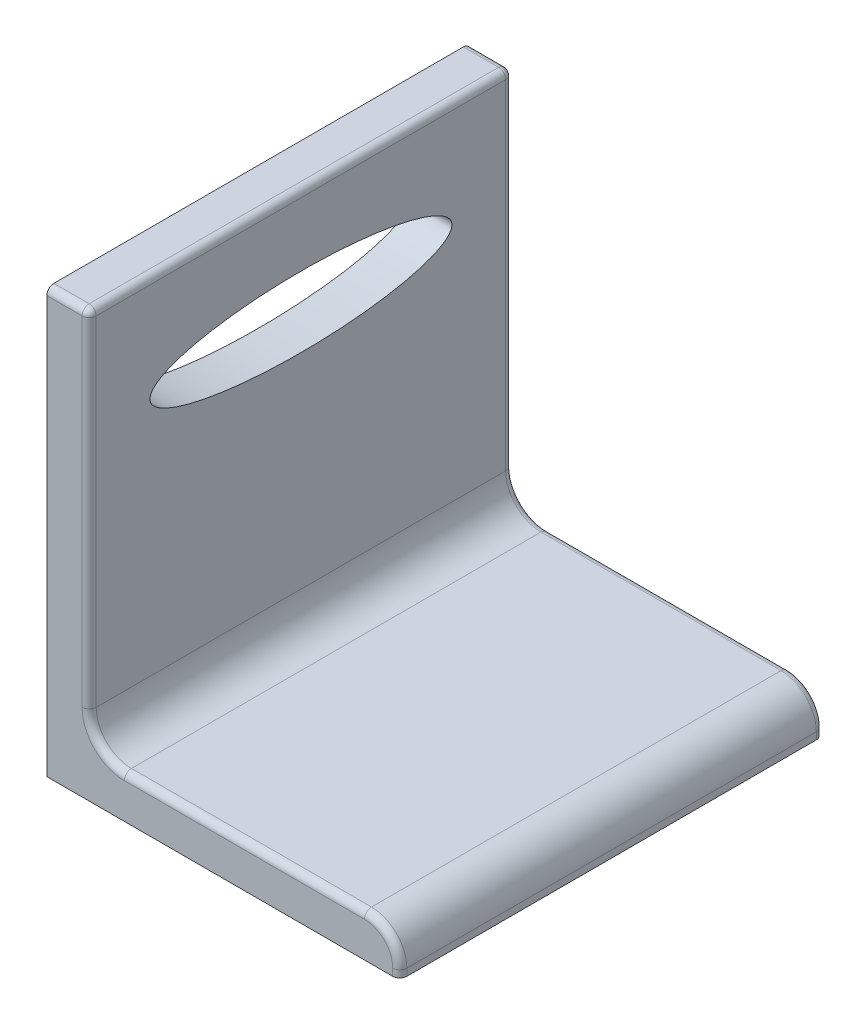
ISO-10303-21;
HEADER;
FILE_DESCRIPTION(('STEP AP214'),'2;1');
FILE_NAME('part.step','',(''),(''),'','','');
FILE_SCHEMA(('AUTOMOTIVE_DESIGN { 1 0 10303 214 1 1 1 1 }'));
ENDSEC;
DATA;
#1=APPLICATION_CONTEXT('core data for automotive mechanical design processes');
#2=APPLICATION_PROTOCOL_DEFINITION('international standard','automotive_design',2000,#1);
#3=PRODUCT_CONTEXT('',#1,'mechanical');
#4=PRODUCT('Part','Part','',(#3));
#5=PRODUCT_RELATED_PRODUCT_CATEGORY('part','',(#4));
#6=PRODUCT_DEFINITION_FORMATION('','',#4);
#7=PRODUCT_DEFINITION_CONTEXT('part definition',#1,'design');
#8=PRODUCT_DEFINITION('design','',#6,#7);
#9=PRODUCT_DEFINITION_SHAPE('','',#8);
#10=(LENGTH_UNIT() NAMED_UNIT(*) SI_UNIT(.MILLI.,.METRE.));
#11=(NAMED_UNIT(*) PLANE_ANGLE_UNIT() SI_UNIT($,.RADIAN.));
#12=(NAMED_UNIT(*) SI_UNIT($,.STERADIAN.) SOLID_ANGLE_UNIT());
#13=UNCERTAINTY_MEASURE_WITH_UNIT(LENGTH_MEASURE(1.E-05),#10,'distance_accuracy_value','');
#14=(GEOMETRIC_REPRESENTATION_CONTEXT(3) GLOBAL_UNCERTAINTY_ASSIGNED_CONTEXT((#13)) GLOBAL_UNIT_ASSIGNED_CONTEXT((#10,
#11,#12)) REPRESENTATION_CONTEXT('',''));
#15=CARTESIAN_POINT('',(0.,0.,0.));
#16=DIRECTION('',(0.,0.,1.));
#17=DIRECTION('',(1.,0.,0.));
#18=AXIS2_PLACEMENT_3D('',#15,#16,#17);
#19=CARTESIAN_POINT('',(0.,0.,-120.));
#20=DIRECTION('',(1.,0.,0.));
#21=DIRECTION('',(0.,0.,-1.));
#22=AXIS2_PLACEMENT_3D('',#19,#20,#21);
#23=PLANE('',#22);
#24=CARTESIAN_POINT('',(0.,90.,-60.));
#25=DIRECTION('',(-1.,0.,0.));
#26=DIRECTION('',(0.,0.,1.));
#27=AXIS2_PLACEMENT_3D('',#24,#25,#26);
#28=ELLIPSE('',#27,42.771597921815,9.99999999999999);
#29=CARTESIAN_POINT('',(0.,90.,-17.228402078185));
#30=VERTEX_POINT('',#29);
#31=EDGE_CURVE('E236',#30,#30,#28,.T.);
#32=ORIENTED_EDGE('',*,*,#31,.F.);
#33=EDGE_LOOP('',(#32));
#34=FACE_BOUND('',#33,.T.);
#35=DIRECTION('',(0.,0.,1.));
#36=VECTOR('',#35,1.);
#37=CARTESIAN_POINT('',(0.,120.,-120.));
#38=LINE('',#37,#36);
#39=CARTESIAN_POINT('',(0.,120.,-118.));
#40=VERTEX_POINT('',#39);
#41=CARTESIAN_POINT('',(0.,120.,-2.));
#42=VERTEX_POINT('',#41);
#43=EDGE_CURVE('E183',#40,#42,#38,.T.);
#44=ORIENTED_EDGE('',*,*,#43,.F.);
#45=CARTESIAN_POINT('',(0.,118.,-118.));
#46=DIRECTION('',(1.,0.,0.));
#47=DIRECTION('',(0.,0.,-1.));
#48=AXIS2_PLACEMENT_3D('',#45,#46,#47);
#49=CIRCLE('',#48,2.);
#50=CARTESIAN_POINT('',(0.,118.,-120.));
#51=VERTEX_POINT('',#50);
#52=EDGE_CURVE('E168',#40,#51,#49,.F.);
#53=ORIENTED_EDGE('',*,*,#52,.T.);
#54=DIRECTION('',(0.,1.,0.));
#55=VECTOR('',#54,1.);
#56=CARTESIAN_POINT('',(0.,0.,-120.));
#57=LINE('',#56,#55);
#58=CARTESIAN_POINT('',(0.,0.,-120.));
#59=VERTEX_POINT('',#58);
#60=EDGE_CURVE('E165',#59,#51,#57,.T.);
#61=ORIENTED_EDGE('',*,*,#60,.F.);
#62=DIRECTION('',(0.,0.,1.));
#63=VECTOR('',#62,1.);
#64=CARTESIAN_POINT('',(0.,0.,-120.));
#65=LINE('',#64,#63);
#66=CARTESIAN_POINT('',(0.,0.,0.));
#67=VERTEX_POINT('',#66);
#68=EDGE_CURVE('E151',#59,#67,#65,.T.);
#69=ORIENTED_EDGE('',*,*,#68,.T.);
#70=DIRECTION('',(0.,1.,0.));
#71=VECTOR('',#70,1.);
#72=CARTESIAN_POINT('',(0.,0.,0.));
#73=LINE('',#72,#71);
#74=CARTESIAN_POINT('',(0.,118.,0.));
#75=VERTEX_POINT('',#74);
#76=EDGE_CURVE('E179',#67,#75,#73,.T.);
#77=ORIENTED_EDGE('',*,*,#76,.T.);
#78=CARTESIAN_POINT('',(0.,118.,-2.));
#79=DIRECTION('',(1.,0.,0.));
#80=DIRECTION('',(0.,0.,-1.));
#81=AXIS2_PLACEMENT_3D('',#78,#79,#80);
#82=CIRCLE('',#81,2.);
#83=EDGE_CURVE('E276',#75,#42,#82,.F.);
#84=ORIENTED_EDGE('',*,*,#83,.T.);
#85=EDGE_LOOP('',(#44,#53,#61,#69,#77,#84));
#86=FACE_BOUND('',#85,.T.);
#87=ADVANCED_FACE('F36',(#34,#86),#23,.F.);
#88=CARTESIAN_POINT('',(0.,120.,-120.));
#89=DIRECTION('',(0.,-1.,0.));
#90=DIRECTION('',(0.,0.,-1.));
#91=AXIS2_PLACEMENT_3D('',#88,#89,#90);
#92=PLANE('',#91);
#93=DIRECTION('',(0.,0.,1.));
#94=VECTOR('',#93,1.);
#95=CARTESIAN_POINT('',(10.,120.,-118.));
#96=LINE('',#95,#94);
#97=CARTESIAN_POINT('',(10.,120.,-2.));
#98=VERTEX_POINT('',#97);
#99=CARTESIAN_POINT('',(10.,120.,-118.));
#100=VERTEX_POINT('',#99);
#101=EDGE_CURVE('E272',#98,#100,#96,.F.);
#102=ORIENTED_EDGE('',*,*,#101,.T.);
#103=DIRECTION('',(1.,0.,0.));
#104=VECTOR('',#103,1.);
#105=CARTESIAN_POINT('',(0.,120.,-118.));
#106=LINE('',#105,#104);
#107=EDGE_CURVE('E274',#100,#40,#106,.F.);
#108=ORIENTED_EDGE('',*,*,#107,.T.);
#109=ORIENTED_EDGE('',*,*,#43,.T.);
#110=DIRECTION('',(1.,0.,0.));
#111=VECTOR('',#110,1.);
#112=CARTESIAN_POINT('',(10.,120.,-2.));
#113=LINE('',#112,#111);
#114=EDGE_CURVE('E270',#42,#98,#113,.T.);
#115=ORIENTED_EDGE('',*,*,#114,.T.);
#116=EDGE_LOOP('',(#102,#108,#109,#115));
#117=FACE_BOUND('',#116,.T.);
#118=ADVANCED_FACE('F303',(#117),#92,.F.);
#119=CARTESIAN_POINT('',(12.,0.,-120.));
#120=DIRECTION('',(1.,0.,0.));
#121=DIRECTION('',(0.,0.,-1.));
#122=AXIS2_PLACEMENT_3D('',#119,#120,#121);
#123=PLANE('',#122);
#124=CARTESIAN_POINT('',(12.,90.,-60.));
#125=DIRECTION('',(-1.,0.,0.));
#126=DIRECTION('',(0.,0.,1.));
#127=AXIS2_PLACEMENT_3D('',#124,#125,#126);
#128=ELLIPSE('',#127,42.771597921815,9.99999999999999);
#129=CARTESIAN_POINT('',(12.,90.,-17.228402078185));
#130=VERTEX_POINT('',#129);
#131=EDGE_CURVE('E181',#130,#130,#128,.T.);
#132=ORIENTED_EDGE('',*,*,#131,.T.);
#133=EDGE_LOOP('',(#132));
#134=FACE_BOUND('',#133,.T.);
#135=DIRECTION('',(0.,1.,0.));
#136=VECTOR('',#135,1.);
#137=CARTESIAN_POINT('',(12.,120.,-118.));
#138=LINE('',#137,#136);
#139=CARTESIAN_POINT('',(12.,22.,-118.));
#140=VERTEX_POINT('',#139);
#141=CARTESIAN_POINT('',(12.,118.,-118.));
#142=VERTEX_POINT('',#141);
#143=EDGE_CURVE('E223',#140,#142,#138,.T.);
#144=ORIENTED_EDGE('',*,*,#143,.T.);
#145=DIRECTION('',(0.,0.,1.));
#146=VECTOR('',#145,1.);
#147=CARTESIAN_POINT('',(12.,118.,-2.));
#148=LINE('',#147,#146);
#149=CARTESIAN_POINT('',(12.,118.,-2.));
#150=VERTEX_POINT('',#149);
#151=EDGE_CURVE('E60',#142,#150,#148,.T.);
#152=ORIENTED_EDGE('',*,*,#151,.T.);
#153=DIRECTION('',(0.,1.,0.));
#154=VECTOR('',#153,1.);
#155=CARTESIAN_POINT('',(12.,0.,-2.));
#156=LINE('',#155,#154);
#157=CARTESIAN_POINT('',(12.,22.,-2.));
#158=VERTEX_POINT('',#157);
#159=EDGE_CURVE('E213',#150,#158,#156,.F.);
#160=ORIENTED_EDGE('',*,*,#159,.T.);
#161=DIRECTION('',(0.,0.,1.));
#162=VECTOR('',#161,1.);
#163=CARTESIAN_POINT('',(12.,22.,-120.));
#164=LINE('',#163,#162);
#165=EDGE_CURVE('E194',#158,#140,#164,.F.);
#166=ORIENTED_EDGE('',*,*,#165,.T.);
#167=EDGE_LOOP('',(#144,#152,#160,#166));
#168=FACE_BOUND('',#167,.T.);
#169=ADVANCED_FACE('F370',(#134,#168),#123,.T.);
#170=CARTESIAN_POINT('',(0.,12.,-120.));
#171=DIRECTION('',(0.,-1.,0.));
#172=DIRECTION('',(0.,0.,-1.));
#173=AXIS2_PLACEMENT_3D('',#170,#171,#172);
#174=PLANE('',#173);
#175=DIRECTION('',(0.,0.,1.));
#176=VECTOR('',#175,1.);
#177=CARTESIAN_POINT('',(90.,12.,-120.));
#178=LINE('',#177,#176);
#179=CARTESIAN_POINT('',(90.,12.,-2.));
#180=VERTEX_POINT('',#179);
#181=CARTESIAN_POINT('',(90.,12.,-118.));
#182=VERTEX_POINT('',#181);
#183=EDGE_CURVE('E189',#180,#182,#178,.F.);
#184=ORIENTED_EDGE('',*,*,#183,.T.);
#185=DIRECTION('',(1.,0.,0.));
#186=VECTOR('',#185,1.);
#187=CARTESIAN_POINT('',(0.,12.,-118.));
#188=LINE('',#187,#186);
#189=CARTESIAN_POINT('',(22.,12.,-118.));
#190=VERTEX_POINT('',#189);
#191=EDGE_CURVE('E249',#182,#190,#188,.F.);
#192=ORIENTED_EDGE('',*,*,#191,.T.);
#193=DIRECTION('',(0.,0.,1.));
#194=VECTOR('',#193,1.);
#195=CARTESIAN_POINT('',(22.,12.,-120.));
#196=LINE('',#195,#194);
#197=CARTESIAN_POINT('',(22.,12.,-2.));
#198=VERTEX_POINT('',#197);
#199=EDGE_CURVE('E192',#190,#198,#196,.T.);
#200=ORIENTED_EDGE('',*,*,#199,.T.);
#201=DIRECTION('',(1.,0.,0.));
#202=VECTOR('',#201,1.);
#203=CARTESIAN_POINT('',(90.,12.,-2.));
#204=LINE('',#203,#202);
#205=EDGE_CURVE('E218',#198,#180,#204,.T.);
#206=ORIENTED_EDGE('',*,*,#205,.T.);
#207=EDGE_LOOP('',(#184,#192,#200,#206));
#208=FACE_BOUND('',#207,.T.);
#209=ADVANCED_FACE('F360',(#208),#174,.F.);
#210=CARTESIAN_POINT('',(100.,0.,-120.));
#211=DIRECTION('',(1.,0.,0.));
#212=DIRECTION('',(0.,0.,-1.));
#213=AXIS2_PLACEMENT_3D('',#210,#211,#212);
#214=PLANE('',#213);
#215=DIRECTION('',(0.,0.,1.));
#216=VECTOR('',#215,1.);
#217=CARTESIAN_POINT('',(100.,0.,-120.));
#218=LINE('',#217,#216);
#219=CARTESIAN_POINT('',(100.,0.,-118.));
#220=VERTEX_POINT('',#219);
#221=CARTESIAN_POINT('',(100.,0.,-2.));
#222=VERTEX_POINT('',#221);
#223=EDGE_CURVE('E162',#220,#222,#218,.T.);
#224=ORIENTED_EDGE('',*,*,#223,.F.);
#225=DIRECTION('',(0.,1.,0.));
#226=VECTOR('',#225,1.);
#227=CARTESIAN_POINT('',(100.,2.,-118.));
#228=LINE('',#227,#226);
#229=CARTESIAN_POINT('',(100.,2.,-118.));
#230=VERTEX_POINT('',#229);
#231=EDGE_CURVE('E251',#220,#230,#228,.T.);
#232=ORIENTED_EDGE('',*,*,#231,.T.);
#233=DIRECTION('',(0.,0.,1.));
#234=VECTOR('',#233,1.);
#235=CARTESIAN_POINT('',(100.,2.,0.));
#236=LINE('',#235,#234);
#237=CARTESIAN_POINT('',(100.,2.,-2.));
#238=VERTEX_POINT('',#237);
#239=EDGE_CURVE('E186',#230,#238,#236,.T.);
#240=ORIENTED_EDGE('',*,*,#239,.T.);
#241=DIRECTION('',(0.,1.,0.));
#242=VECTOR('',#241,1.);
#243=CARTESIAN_POINT('',(100.,0.,-2.));
#244=LINE('',#243,#242);
#245=EDGE_CURVE('E208',#238,#222,#244,.F.);
#246=ORIENTED_EDGE('',*,*,#245,.T.);
#247=EDGE_LOOP('',(#224,#232,#240,#246));
#248=FACE_BOUND('',#247,.T.);
#249=ADVANCED_FACE('F337',(#248),#214,.T.);
#250=CARTESIAN_POINT('',(0.,0.,-120.));
#251=DIRECTION('',(0.,-1.,0.));
#252=DIRECTION('',(0.,0.,-1.));
#253=AXIS2_PLACEMENT_3D('',#250,#251,#252);
#254=PLANE('',#253);
#255=DIRECTION('',(1.,0.,0.));
#256=VECTOR('',#255,1.);
#257=CARTESIAN_POINT('',(0.,0.,-120.));
#258=LINE('',#257,#256);
#259=CARTESIAN_POINT('',(98.,0.,-120.));
#260=VERTEX_POINT('',#259);
#261=EDGE_CURVE('E155',#59,#260,#258,.T.);
#262=ORIENTED_EDGE('',*,*,#261,.T.);
#263=CARTESIAN_POINT('',(98.,0.,-118.));
#264=DIRECTION('',(0.,-1.,0.));
#265=DIRECTION('',(0.,0.,-1.));
#266=AXIS2_PLACEMENT_3D('',#263,#264,#265);
#267=CIRCLE('',#266,2.);
#268=EDGE_CURVE('E253',#260,#220,#267,.T.);
#269=ORIENTED_EDGE('',*,*,#268,.T.);
#270=ORIENTED_EDGE('',*,*,#223,.T.);
#271=CARTESIAN_POINT('',(98.,0.,-2.));
#272=DIRECTION('',(0.,-1.,0.));
#273=DIRECTION('',(0.,0.,-1.));
#274=AXIS2_PLACEMENT_3D('',#271,#272,#273);
#275=CIRCLE('',#274,2.);
#276=CARTESIAN_POINT('',(98.,0.,0.));
#277=VERTEX_POINT('',#276);
#278=EDGE_CURVE('E211',#222,#277,#275,.T.);
#279=ORIENTED_EDGE('',*,*,#278,.T.);
#280=DIRECTION('',(1.,0.,0.));
#281=VECTOR('',#280,1.);
#282=CARTESIAN_POINT('',(0.,0.,0.));
#283=LINE('',#282,#281);
#284=EDGE_CURVE('E158',#67,#277,#283,.T.);
#285=ORIENTED_EDGE('',*,*,#284,.F.);
#286=ORIENTED_EDGE('',*,*,#68,.F.);
#287=EDGE_LOOP('',(#262,#269,#270,#279,#285,#286));
#288=FACE_BOUND('',#287,.T.);
#289=ADVANCED_FACE('F153',(#288),#254,.T.);
#290=CARTESIAN_POINT('',(0.,0.,-120.));
#291=DIRECTION('',(0.,0.,1.));
#292=DIRECTION('',(1.,0.,0.));
#293=AXIS2_PLACEMENT_3D('',#290,#291,#292);
#294=PLANE('',#293);
#295=ORIENTED_EDGE('',*,*,#60,.T.);
#296=DIRECTION('',(1.,0.,0.));
#297=VECTOR('',#296,1.);
#298=CARTESIAN_POINT('',(0.,118.,-120.));
#299=LINE('',#298,#297);
#300=CARTESIAN_POINT('',(10.,118.,-120.));
#301=VERTEX_POINT('',#300);
#302=EDGE_CURVE('E257',#51,#301,#299,.T.);
#303=ORIENTED_EDGE('',*,*,#302,.T.);
#304=DIRECTION('',(0.,1.,0.));
#305=VECTOR('',#304,1.);
#306=CARTESIAN_POINT('',(10.,22.,-120.));
#307=LINE('',#306,#305);
#308=CARTESIAN_POINT('',(10.,22.,-120.));
#309=VERTEX_POINT('',#308);
#310=EDGE_CURVE('E245',#301,#309,#307,.F.);
#311=ORIENTED_EDGE('',*,*,#310,.T.);
#312=CARTESIAN_POINT('',(22.,22.,-120.));
#313=DIRECTION('',(0.,0.,1.));
#314=DIRECTION('',(1.,0.,0.));
#315=AXIS2_PLACEMENT_3D('',#312,#313,#314);
#316=CIRCLE('',#315,12.);
#317=CARTESIAN_POINT('',(22.,10.,-120.));
#318=VERTEX_POINT('',#317);
#319=EDGE_CURVE('E243',#309,#318,#316,.T.);
#320=ORIENTED_EDGE('',*,*,#319,.T.);
#321=DIRECTION('',(1.,0.,0.));
#322=VECTOR('',#321,1.);
#323=CARTESIAN_POINT('',(0.,10.,-120.));
#324=LINE('',#323,#322);
#325=CARTESIAN_POINT('',(90.,10.,-120.));
#326=VERTEX_POINT('',#325);
#327=EDGE_CURVE('E241',#318,#326,#324,.T.);
#328=ORIENTED_EDGE('',*,*,#327,.T.);
#329=CARTESIAN_POINT('',(90.,2.,-120.));
#330=DIRECTION('',(0.,0.,1.));
#331=DIRECTION('',(1.,0.,0.));
#332=AXIS2_PLACEMENT_3D('',#329,#330,#331);
#333=CIRCLE('',#332,8.);
#334=CARTESIAN_POINT('',(98.,2.,-120.));
#335=VERTEX_POINT('',#334);
#336=EDGE_CURVE('E238',#326,#335,#333,.F.);
#337=ORIENTED_EDGE('',*,*,#336,.T.);
#338=DIRECTION('',(0.,1.,0.));
#339=VECTOR('',#338,1.);
#340=CARTESIAN_POINT('',(98.,0.,-120.));
#341=LINE('',#340,#339);
#342=EDGE_CURVE('E175',#335,#260,#341,.F.);
#343=ORIENTED_EDGE('',*,*,#342,.T.);
#344=ORIENTED_EDGE('',*,*,#261,.F.);
#345=EDGE_LOOP('',(#295,#303,#311,#320,#328,#337,#343,#344));
#346=FACE_BOUND('',#345,.T.);
#347=ADVANCED_FACE('F173',(#346),#294,.F.);
#348=CARTESIAN_POINT('',(0.,0.,0.));
#349=DIRECTION('',(0.,0.,1.));
#350=DIRECTION('',(1.,0.,0.));
#351=AXIS2_PLACEMENT_3D('',#348,#349,#350);
#352=PLANE('',#351);
#353=DIRECTION('',(0.,1.,0.));
#354=VECTOR('',#353,1.);
#355=CARTESIAN_POINT('',(10.,0.,0.));
#356=LINE('',#355,#354);
#357=CARTESIAN_POINT('',(10.,22.,0.));
#358=VERTEX_POINT('',#357);
#359=CARTESIAN_POINT('',(10.,118.,0.));
#360=VERTEX_POINT('',#359);
#361=EDGE_CURVE('E203',#358,#360,#356,.T.);
#362=ORIENTED_EDGE('',*,*,#361,.T.);
#363=DIRECTION('',(1.,0.,0.));
#364=VECTOR('',#363,1.);
#365=CARTESIAN_POINT('',(0.,118.,0.));
#366=LINE('',#365,#364);
#367=EDGE_CURVE('E11',#360,#75,#366,.F.);
#368=ORIENTED_EDGE('',*,*,#367,.T.);
#369=ORIENTED_EDGE('',*,*,#76,.F.);
#370=ORIENTED_EDGE('',*,*,#284,.T.);
#371=DIRECTION('',(0.,1.,0.));
#372=VECTOR('',#371,1.);
#373=CARTESIAN_POINT('',(98.,0.,0.));
#374=LINE('',#373,#372);
#375=CARTESIAN_POINT('',(98.,2.,0.));
#376=VERTEX_POINT('',#375);
#377=EDGE_CURVE('E205',#277,#376,#374,.T.);
#378=ORIENTED_EDGE('',*,*,#377,.T.);
#379=CARTESIAN_POINT('',(90.,2.,0.));
#380=DIRECTION('',(0.,0.,1.));
#381=DIRECTION('',(1.,0.,0.));
#382=AXIS2_PLACEMENT_3D('',#379,#380,#381);
#383=CIRCLE('',#382,8.);
#384=CARTESIAN_POINT('',(90.,10.,0.));
#385=VERTEX_POINT('',#384);
#386=EDGE_CURVE('E197',#376,#385,#383,.T.);
#387=ORIENTED_EDGE('',*,*,#386,.T.);
#388=DIRECTION('',(1.,0.,0.));
#389=VECTOR('',#388,1.);
#390=CARTESIAN_POINT('',(22.,10.,0.));
#391=LINE('',#390,#389);
#392=CARTESIAN_POINT('',(22.,10.,0.));
#393=VERTEX_POINT('',#392);
#394=EDGE_CURVE('E199',#385,#393,#391,.F.);
#395=ORIENTED_EDGE('',*,*,#394,.T.);
#396=CARTESIAN_POINT('',(22.,22.,0.));
#397=DIRECTION('',(0.,0.,1.));
#398=DIRECTION('',(1.,0.,0.));
#399=AXIS2_PLACEMENT_3D('',#396,#397,#398);
#400=CIRCLE('',#399,12.);
#401=EDGE_CURVE('E201',#393,#358,#400,.F.);
#402=ORIENTED_EDGE('',*,*,#401,.T.);
#403=EDGE_LOOP('',(#362,#368,#369,#370,#378,#387,#395,#402));
#404=FACE_BOUND('',#403,.T.);
#405=ADVANCED_FACE('F301',(#404),#352,.T.);
#406=DIRECTION('',(-1.,0.,0.));
#407=VECTOR('',#406,1.);
#408=SURFACE_OF_LINEAR_EXTRUSION('',#128,#407);
#409=ORIENTED_EDGE('',*,*,#131,.F.);
#410=EDGE_LOOP('',(#409));
#411=FACE_BOUND('',#410,.T.);
#412=ORIENTED_EDGE('',*,*,#31,.T.);
#413=EDGE_LOOP('',(#412));
#414=FACE_BOUND('',#413,.T.);
#415=ADVANCED_FACE('F392',(#411,#414),#408,.F.);
#416=CARTESIAN_POINT('',(90.,2.,-120.));
#417=DIRECTION('',(0.,0.,-1.));
#418=DIRECTION('',(-1.,0.,0.));
#419=AXIS2_PLACEMENT_3D('',#416,#417,#418);
#420=CYLINDRICAL_SURFACE('',#419,10.);
#421=ORIENTED_EDGE('',*,*,#239,.F.);
#422=CARTESIAN_POINT('',(90.,2.,-118.));
#423=DIRECTION('',(0.,0.,1.));
#424=DIRECTION('',(1.,0.,0.));
#425=AXIS2_PLACEMENT_3D('',#422,#423,#424);
#426=CIRCLE('',#425,10.);
#427=EDGE_CURVE('E255',#230,#182,#426,.T.);
#428=ORIENTED_EDGE('',*,*,#427,.T.);
#429=ORIENTED_EDGE('',*,*,#183,.F.);
#430=CARTESIAN_POINT('',(90.,2.,-2.));
#431=DIRECTION('',(0.,0.,1.));
#432=DIRECTION('',(1.,0.,0.));
#433=AXIS2_PLACEMENT_3D('',#430,#431,#432);
#434=CIRCLE('',#433,10.);
#435=EDGE_CURVE('E220',#180,#238,#434,.F.);
#436=ORIENTED_EDGE('',*,*,#435,.T.);
#437=EDGE_LOOP('',(#421,#428,#429,#436));
#438=FACE_BOUND('',#437,.T.);
#439=ADVANCED_FACE('F358',(#438),#420,.T.);
#440=CARTESIAN_POINT('',(22.,22.,-120.));
#441=DIRECTION('',(0.,0.,1.));
#442=DIRECTION('',(1.,0.,0.));
#443=AXIS2_PLACEMENT_3D('',#440,#441,#442);
#444=CYLINDRICAL_SURFACE('',#443,10.);
#445=ORIENTED_EDGE('',*,*,#199,.F.);
#446=CARTESIAN_POINT('',(22.,22.,-118.));
#447=DIRECTION('',(0.,0.,1.));
#448=DIRECTION('',(1.,0.,0.));
#449=AXIS2_PLACEMENT_3D('',#446,#447,#448);
#450=CIRCLE('',#449,10.);
#451=EDGE_CURVE('E247',#190,#140,#450,.F.);
#452=ORIENTED_EDGE('',*,*,#451,.T.);
#453=ORIENTED_EDGE('',*,*,#165,.F.);
#454=CARTESIAN_POINT('',(22.,22.,-2.));
#455=DIRECTION('',(0.,0.,1.));
#456=DIRECTION('',(1.,0.,0.));
#457=AXIS2_PLACEMENT_3D('',#454,#455,#456);
#458=CIRCLE('',#457,10.);
#459=EDGE_CURVE('E215',#158,#198,#458,.T.);
#460=ORIENTED_EDGE('',*,*,#459,.T.);
#461=EDGE_LOOP('',(#445,#452,#453,#460));
#462=FACE_BOUND('',#461,.T.);
#463=ADVANCED_FACE('F365',(#462),#444,.F.);
#464=CARTESIAN_POINT('',(10.,0.,-2.));
#465=DIRECTION('',(0.,1.,0.));
#466=DIRECTION('',(0.,0.,1.));
#467=AXIS2_PLACEMENT_3D('',#464,#465,#466);
#468=CYLINDRICAL_SURFACE('',#467,2.);
#469=ORIENTED_EDGE('',*,*,#159,.F.);
#470=CARTESIAN_POINT('',(10.,118.,-2.));
#471=DIRECTION('',(0.,1.,0.));
#472=DIRECTION('',(0.,0.,1.));
#473=AXIS2_PLACEMENT_3D('',#470,#471,#472);
#474=CIRCLE('',#473,2.);
#475=EDGE_CURVE('E45',#150,#360,#474,.F.);
#476=ORIENTED_EDGE('',*,*,#475,.T.);
#477=ORIENTED_EDGE('',*,*,#361,.F.);
#478=CARTESIAN_POINT('',(10.,22.,-2.));
#479=DIRECTION('',(0.,-1.,0.));
#480=DIRECTION('',(0.,0.,-1.));
#481=AXIS2_PLACEMENT_3D('',#478,#479,#480);
#482=CIRCLE('',#481,2.);
#483=EDGE_CURVE('E233',#158,#358,#482,.T.);
#484=ORIENTED_EDGE('',*,*,#483,.F.);
#485=EDGE_LOOP('',(#469,#476,#477,#484));
#486=FACE_BOUND('',#485,.T.);
#487=ADVANCED_FACE('F369',(#486),#468,.T.);
#488=CARTESIAN_POINT('',(22.,22.,-2.));
#489=DIRECTION('',(0.,0.,1.));
#490=DIRECTION('',(1.,0.,0.));
#491=AXIS2_PLACEMENT_3D('',#488,#489,#490);
#492=TOROIDAL_SURFACE('',#491,12.,2.);
#493=ORIENTED_EDGE('',*,*,#483,.T.);
#494=ORIENTED_EDGE('',*,*,#401,.F.);
#495=CARTESIAN_POINT('',(22.,10.,-2.));
#496=DIRECTION('',(1.,0.,0.));
#497=DIRECTION('',(0.,0.,-1.));
#498=AXIS2_PLACEMENT_3D('',#495,#496,#497);
#499=CIRCLE('',#498,2.);
#500=EDGE_CURVE('E230',#198,#393,#499,.T.);
#501=ORIENTED_EDGE('',*,*,#500,.F.);
#502=ORIENTED_EDGE('',*,*,#459,.F.);
#503=EDGE_LOOP('',(#493,#494,#501,#502));
#504=FACE_BOUND('',#503,.T.);
#505=ADVANCED_FACE('F368',(#504),#492,.T.);
#506=CARTESIAN_POINT('',(0.,10.,-2.));
#507=DIRECTION('',(-1.,0.,0.));
#508=DIRECTION('',(0.,0.,1.));
#509=AXIS2_PLACEMENT_3D('',#506,#507,#508);
#510=CYLINDRICAL_SURFACE('',#509,2.);
#511=ORIENTED_EDGE('',*,*,#500,.T.);
#512=ORIENTED_EDGE('',*,*,#394,.F.);
#513=CARTESIAN_POINT('',(90.,10.,-2.));
#514=DIRECTION('',(1.,0.,0.));
#515=DIRECTION('',(0.,0.,-1.));
#516=AXIS2_PLACEMENT_3D('',#513,#514,#515);
#517=CIRCLE('',#516,2.);
#518=EDGE_CURVE('E226',#180,#385,#517,.T.);
#519=ORIENTED_EDGE('',*,*,#518,.F.);
#520=ORIENTED_EDGE('',*,*,#205,.F.);
#521=EDGE_LOOP('',(#511,#512,#519,#520));
#522=FACE_BOUND('',#521,.T.);
#523=ADVANCED_FACE('F351',(#522),#510,.T.);
#524=CARTESIAN_POINT('',(90.,2.,-2.));
#525=DIRECTION('',(0.,0.,1.));
#526=DIRECTION('',(1.,0.,0.));
#527=AXIS2_PLACEMENT_3D('',#524,#525,#526);
#528=TOROIDAL_SURFACE('',#527,8.,2.);
#529=ORIENTED_EDGE('',*,*,#518,.T.);
#530=ORIENTED_EDGE('',*,*,#386,.F.);
#531=CARTESIAN_POINT('',(98.,2.,-2.));
#532=DIRECTION('',(0.,-1.,0.));
#533=DIRECTION('',(0.,0.,-1.));
#534=AXIS2_PLACEMENT_3D('',#531,#532,#533);
#535=CIRCLE('',#534,2.);
#536=EDGE_CURVE('E224',#238,#376,#535,.T.);
#537=ORIENTED_EDGE('',*,*,#536,.F.);
#538=ORIENTED_EDGE('',*,*,#435,.F.);
#539=EDGE_LOOP('',(#529,#530,#537,#538));
#540=FACE_BOUND('',#539,.T.);
#541=ADVANCED_FACE('F355',(#540),#528,.T.);
#542=CARTESIAN_POINT('',(98.,0.,-2.));
#543=DIRECTION('',(0.,1.,0.));
#544=DIRECTION('',(0.,0.,1.));
#545=AXIS2_PLACEMENT_3D('',#542,#543,#544);
#546=CYLINDRICAL_SURFACE('',#545,2.);
#547=ORIENTED_EDGE('',*,*,#278,.F.);
#548=ORIENTED_EDGE('',*,*,#245,.F.);
#549=ORIENTED_EDGE('',*,*,#536,.T.);
#550=ORIENTED_EDGE('',*,*,#377,.F.);
#551=EDGE_LOOP('',(#547,#548,#549,#550));
#552=FACE_BOUND('',#551,.T.);
#553=ADVANCED_FACE('F344',(#552),#546,.T.);
#554=CARTESIAN_POINT('',(98.,0.,-118.));
#555=DIRECTION('',(0.,-1.,0.));
#556=DIRECTION('',(0.,0.,-1.));
#557=AXIS2_PLACEMENT_3D('',#554,#555,#556);
#558=CYLINDRICAL_SURFACE('',#557,2.);
#559=ORIENTED_EDGE('',*,*,#268,.F.);
#560=ORIENTED_EDGE('',*,*,#342,.F.);
#561=CARTESIAN_POINT('',(98.,2.,-118.));
#562=DIRECTION('',(0.,1.,0.));
#563=DIRECTION('',(0.,0.,1.));
#564=AXIS2_PLACEMENT_3D('',#561,#562,#563);
#565=CIRCLE('',#564,2.);
#566=EDGE_CURVE('E227',#230,#335,#565,.T.);
#567=ORIENTED_EDGE('',*,*,#566,.F.);
#568=ORIENTED_EDGE('',*,*,#231,.F.);
#569=EDGE_LOOP('',(#559,#560,#567,#568));
#570=FACE_BOUND('',#569,.T.);
#571=ADVANCED_FACE('F333',(#570),#558,.T.);
#572=CARTESIAN_POINT('',(90.,2.,-118.));
#573=DIRECTION('',(0.,0.,1.));
#574=DIRECTION('',(1.,0.,0.));
#575=AXIS2_PLACEMENT_3D('',#572,#573,#574);
#576=TOROIDAL_SURFACE('',#575,8.,2.);
#577=ORIENTED_EDGE('',*,*,#566,.T.);
#578=ORIENTED_EDGE('',*,*,#336,.F.);
#579=CARTESIAN_POINT('',(90.,10.,-118.));
#580=DIRECTION('',(-1.,0.,0.));
#581=DIRECTION('',(0.,0.,1.));
#582=AXIS2_PLACEMENT_3D('',#579,#580,#581);
#583=CIRCLE('',#582,2.);
#584=EDGE_CURVE('E264',#182,#326,#583,.T.);
#585=ORIENTED_EDGE('',*,*,#584,.F.);
#586=ORIENTED_EDGE('',*,*,#427,.F.);
#587=EDGE_LOOP('',(#577,#578,#585,#586));
#588=FACE_BOUND('',#587,.T.);
#589=ADVANCED_FACE('F330',(#588),#576,.T.);
#590=CARTESIAN_POINT('',(0.,10.,-118.));
#591=DIRECTION('',(1.,0.,0.));
#592=DIRECTION('',(0.,0.,-1.));
#593=AXIS2_PLACEMENT_3D('',#590,#591,#592);
#594=CYLINDRICAL_SURFACE('',#593,2.);
#595=ORIENTED_EDGE('',*,*,#584,.T.);
#596=ORIENTED_EDGE('',*,*,#327,.F.);
#597=CARTESIAN_POINT('',(22.,10.,-118.));
#598=DIRECTION('',(-1.,0.,0.));
#599=DIRECTION('',(0.,0.,1.));
#600=AXIS2_PLACEMENT_3D('',#597,#598,#599);
#601=CIRCLE('',#600,2.);
#602=EDGE_CURVE('E261',#190,#318,#601,.T.);
#603=ORIENTED_EDGE('',*,*,#602,.F.);
#604=ORIENTED_EDGE('',*,*,#191,.F.);
#605=EDGE_LOOP('',(#595,#596,#603,#604));
#606=FACE_BOUND('',#605,.T.);
#607=ADVANCED_FACE('F325',(#606),#594,.T.);
#608=CARTESIAN_POINT('',(22.,22.,-118.));
#609=DIRECTION('',(0.,0.,1.));
#610=DIRECTION('',(1.,0.,0.));
#611=AXIS2_PLACEMENT_3D('',#608,#609,#610);
#612=TOROIDAL_SURFACE('',#611,12.,2.);
#613=ORIENTED_EDGE('',*,*,#602,.T.);
#614=ORIENTED_EDGE('',*,*,#319,.F.);
#615=CARTESIAN_POINT('',(10.,22.,-118.));
#616=DIRECTION('',(0.,1.,0.));
#617=DIRECTION('',(0.,0.,1.));
#618=AXIS2_PLACEMENT_3D('',#615,#616,#617);
#619=CIRCLE('',#618,2.);
#620=EDGE_CURVE('E258',#140,#309,#619,.T.);
#621=ORIENTED_EDGE('',*,*,#620,.F.);
#622=ORIENTED_EDGE('',*,*,#451,.F.);
#623=EDGE_LOOP('',(#613,#614,#621,#622));
#624=FACE_BOUND('',#623,.T.);
#625=ADVANCED_FACE('F320',(#624),#612,.T.);
#626=CARTESIAN_POINT('',(10.,0.,-118.));
#627=DIRECTION('',(0.,-1.,0.));
#628=DIRECTION('',(0.,0.,-1.));
#629=AXIS2_PLACEMENT_3D('',#626,#627,#628);
#630=CYLINDRICAL_SURFACE('',#629,2.);
#631=ORIENTED_EDGE('',*,*,#310,.F.);
#632=CARTESIAN_POINT('',(10.,118.,-118.));
#633=DIRECTION('',(0.,-1.,0.));
#634=DIRECTION('',(0.,0.,-1.));
#635=AXIS2_PLACEMENT_3D('',#632,#633,#634);
#636=CIRCLE('',#635,2.);
#637=EDGE_CURVE('E279',#301,#142,#636,.T.);
#638=ORIENTED_EDGE('',*,*,#637,.T.);
#639=ORIENTED_EDGE('',*,*,#143,.F.);
#640=ORIENTED_EDGE('',*,*,#620,.T.);
#641=EDGE_LOOP('',(#631,#638,#639,#640));
#642=FACE_BOUND('',#641,.T.);
#643=ADVANCED_FACE('F316',(#642),#630,.T.);
#644=CARTESIAN_POINT('',(0.,118.,-2.));
#645=DIRECTION('',(-1.,0.,0.));
#646=DIRECTION('',(0.,0.,1.));
#647=AXIS2_PLACEMENT_3D('',#644,#645,#646);
#648=CYLINDRICAL_SURFACE('',#647,2.);
#649=ORIENTED_EDGE('',*,*,#83,.F.);
#650=ORIENTED_EDGE('',*,*,#367,.F.);
#651=CARTESIAN_POINT('',(10.,118.,-2.));
#652=DIRECTION('',(1.,0.,0.));
#653=DIRECTION('',(0.,0.,-1.));
#654=AXIS2_PLACEMENT_3D('',#651,#652,#653);
#655=CIRCLE('',#654,2.);
#656=EDGE_CURVE('E40',#98,#360,#655,.T.);
#657=ORIENTED_EDGE('',*,*,#656,.F.);
#658=ORIENTED_EDGE('',*,*,#114,.F.);
#659=EDGE_LOOP('',(#649,#650,#657,#658));
#660=FACE_BOUND('',#659,.T.);
#661=ADVANCED_FACE('F38',(#660),#648,.T.);
#662=CARTESIAN_POINT('',(10.,118.,-2.));
#663=DIRECTION('',(0.,0.,1.));
#664=DIRECTION('',(1.,0.,0.));
#665=AXIS2_PLACEMENT_3D('',#662,#663,#664);
#666=SPHERICAL_SURFACE('',#665,2.);
#667=ORIENTED_EDGE('',*,*,#656,.T.);
#668=ORIENTED_EDGE('',*,*,#475,.F.);
#669=CARTESIAN_POINT('',(10.,118.,-2.));
#670=DIRECTION('',(0.,0.,-1.));
#671=DIRECTION('',(-1.,0.,0.));
#672=AXIS2_PLACEMENT_3D('',#669,#670,#671);
#673=CIRCLE('',#672,2.);
#674=EDGE_CURVE('E287',#98,#150,#673,.T.);
#675=ORIENTED_EDGE('',*,*,#674,.F.);
#676=EDGE_LOOP('',(#667,#668,#675));
#677=FACE_BOUND('',#676,.T.);
#678=ADVANCED_FACE('F295',(#677),#666,.T.);
#679=CARTESIAN_POINT('',(10.,118.,-120.));
#680=DIRECTION('',(0.,0.,-1.));
#681=DIRECTION('',(-1.,0.,0.));
#682=AXIS2_PLACEMENT_3D('',#679,#680,#681);
#683=CYLINDRICAL_SURFACE('',#682,2.);
#684=ORIENTED_EDGE('',*,*,#674,.T.);
#685=ORIENTED_EDGE('',*,*,#151,.F.);
#686=CARTESIAN_POINT('',(10.,118.,-118.));
#687=DIRECTION('',(0.,0.,-1.));
#688=DIRECTION('',(-1.,0.,0.));
#689=AXIS2_PLACEMENT_3D('',#686,#687,#688);
#690=CIRCLE('',#689,2.);
#691=EDGE_CURVE('E285',#100,#142,#690,.T.);
#692=ORIENTED_EDGE('',*,*,#691,.F.);
#693=ORIENTED_EDGE('',*,*,#101,.F.);
#694=EDGE_LOOP('',(#684,#685,#692,#693));
#695=FACE_BOUND('',#694,.T.);
#696=ADVANCED_FACE('F371',(#695),#683,.T.);
#697=CARTESIAN_POINT('',(10.,118.,-118.));
#698=DIRECTION('',(0.,0.,1.));
#699=DIRECTION('',(1.,0.,0.));
#700=AXIS2_PLACEMENT_3D('',#697,#698,#699);
#701=SPHERICAL_SURFACE('',#700,2.);
#702=ORIENTED_EDGE('',*,*,#691,.T.);
#703=ORIENTED_EDGE('',*,*,#637,.F.);
#704=CARTESIAN_POINT('',(10.,118.,-118.));
#705=DIRECTION('',(-1.,0.,0.));
#706=DIRECTION('',(0.,0.,1.));
#707=AXIS2_PLACEMENT_3D('',#704,#705,#706);
#708=CIRCLE('',#707,2.);
#709=EDGE_CURVE('E283',#100,#301,#708,.T.);
#710=ORIENTED_EDGE('',*,*,#709,.F.);
#711=EDGE_LOOP('',(#702,#703,#710));
#712=FACE_BOUND('',#711,.T.);
#713=ADVANCED_FACE('F311',(#712),#701,.T.);
#714=CARTESIAN_POINT('',(0.,118.,-118.));
#715=DIRECTION('',(1.,0.,0.));
#716=DIRECTION('',(0.,0.,-1.));
#717=AXIS2_PLACEMENT_3D('',#714,#715,#716);
#718=CYLINDRICAL_SURFACE('',#717,2.);
#719=ORIENTED_EDGE('',*,*,#52,.F.);
#720=ORIENTED_EDGE('',*,*,#107,.F.);
#721=ORIENTED_EDGE('',*,*,#709,.T.);
#722=ORIENTED_EDGE('',*,*,#302,.F.);
#723=EDGE_LOOP('',(#719,#720,#721,#722));
#724=FACE_BOUND('',#723,.T.);
#725=ADVANCED_FACE('F308',(#724),#718,.T.);
#726=CLOSED_SHELL('',(#87,#118,#169,#209,#249,#289,#347,#405,#415,#439,#463,#487,#505,#523,#541,
#553,#571,#589,#607,#625,#643,#661,#678,#696,#713,#725));
#727=MANIFOLD_SOLID_BREP('B2',#726);
#728=ADVANCED_BREP_SHAPE_REPRESENTATION('',(#18,#727),#14);
#729=SHAPE_DEFINITION_REPRESENTATION(#9,#728);
ENDSEC;
END-ISO-10303-21;
